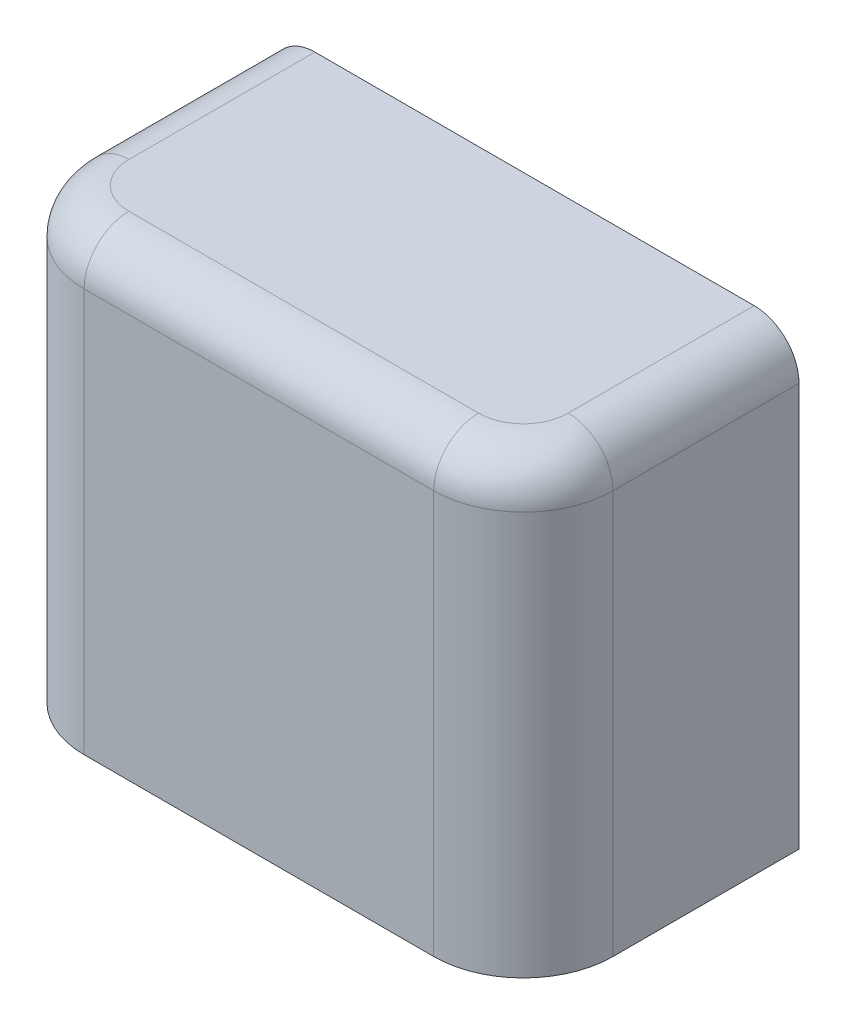
ISO-10303-21;
HEADER;
FILE_DESCRIPTION(('STEP AP214'),'2;1');
FILE_NAME('part.step','',(''),(''),'','','');
FILE_SCHEMA(('AUTOMOTIVE_DESIGN { 1 0 10303 214 1 1 1 1 }'));
ENDSEC;
DATA;
#1=APPLICATION_CONTEXT('core data for automotive mechanical design processes');
#2=APPLICATION_PROTOCOL_DEFINITION('international standard','automotive_design',2000,#1);
#3=PRODUCT_CONTEXT('',#1,'mechanical');
#4=PRODUCT('Part','Part','',(#3));
#5=PRODUCT_RELATED_PRODUCT_CATEGORY('part','',(#4));
#6=PRODUCT_DEFINITION_FORMATION('','',#4);
#7=PRODUCT_DEFINITION_CONTEXT('part definition',#1,'design');
#8=PRODUCT_DEFINITION('design','',#6,#7);
#9=PRODUCT_DEFINITION_SHAPE('','',#8);
#10=(LENGTH_UNIT() NAMED_UNIT(*) SI_UNIT(.MILLI.,.METRE.));
#11=(NAMED_UNIT(*) PLANE_ANGLE_UNIT() SI_UNIT($,.RADIAN.));
#12=(NAMED_UNIT(*) SI_UNIT($,.STERADIAN.) SOLID_ANGLE_UNIT());
#13=UNCERTAINTY_MEASURE_WITH_UNIT(LENGTH_MEASURE(1.E-05),#10,'distance_accuracy_value','');
#14=(GEOMETRIC_REPRESENTATION_CONTEXT(3) GLOBAL_UNCERTAINTY_ASSIGNED_CONTEXT((#13)) GLOBAL_UNIT_ASSIGNED_CONTEXT((#10,
#11,#12)) REPRESENTATION_CONTEXT('',''));
#15=CARTESIAN_POINT('',(0.,0.,0.));
#16=DIRECTION('',(0.,0.,1.));
#17=DIRECTION('',(1.,0.,0.));
#18=AXIS2_PLACEMENT_3D('',#15,#16,#17);
#19=CARTESIAN_POINT('',(124.500000000011,510.,21.4999999999996));
#20=DIRECTION('',(0.,-1.,0.));
#21=DIRECTION('',(0.,0.,-1.));
#22=AXIS2_PLACEMENT_3D('',#19,#20,#21);
#23=CYLINDRICAL_SURFACE('',#22,40.);
#24=DIRECTION('',(0.,-1.,0.));
#25=VECTOR('',#24,1.);
#26=CARTESIAN_POINT('',(164.500000000011,510.,21.4999999999993));
#27=LINE('',#26,#25);
#28=CARTESIAN_POINT('',(164.500000000011,490.,21.4999999999993));
#29=VERTEX_POINT('',#28);
#30=CARTESIAN_POINT('',(164.500000000011,310.,21.4999999999993));
#31=VERTEX_POINT('',#30);
#32=EDGE_CURVE('E87',#29,#31,#27,.T.);
#33=ORIENTED_EDGE('',*,*,#32,.F.);
#34=CARTESIAN_POINT('',(124.500000000011,490.,21.4999999999996));
#35=DIRECTION('',(0.,1.,0.));
#36=DIRECTION('',(0.,0.,1.));
#37=AXIS2_PLACEMENT_3D('',#34,#35,#36);
#38=CIRCLE('',#37,40.);
#39=CARTESIAN_POINT('',(124.50000000001,490.,61.5));
#40=VERTEX_POINT('',#39);
#41=EDGE_CURVE('E26',#29,#40,#38,.F.);
#42=ORIENTED_EDGE('',*,*,#41,.T.);
#43=DIRECTION('',(0.,-1.,0.));
#44=VECTOR('',#43,1.);
#45=CARTESIAN_POINT('',(124.50000000001,510.,61.5));
#46=LINE('',#45,#44);
#47=CARTESIAN_POINT('',(124.50000000001,310.,61.5));
#48=VERTEX_POINT('',#47);
#49=EDGE_CURVE('E106',#40,#48,#46,.T.);
#50=ORIENTED_EDGE('',*,*,#49,.T.);
#51=CARTESIAN_POINT('',(124.500000000011,310.,21.4999999999996));
#52=DIRECTION('',(0.,1.,0.));
#53=DIRECTION('',(0.,0.,1.));
#54=AXIS2_PLACEMENT_3D('',#51,#52,#53);
#55=CIRCLE('',#54,40.);
#56=EDGE_CURVE('E101',#48,#31,#55,.T.);
#57=ORIENTED_EDGE('',*,*,#56,.T.);
#58=EDGE_LOOP('',(#33,#42,#50,#57));
#59=FACE_BOUND('',#58,.T.);
#60=ADVANCED_FACE('F17',(#59),#23,.T.);
#61=CARTESIAN_POINT('',(164.500000000011,510.,21.4999999999993));
#62=DIRECTION('',(-1.,0.,0.));
#63=DIRECTION('',(0.,0.,1.));
#64=AXIS2_PLACEMENT_3D('',#61,#62,#63);
#65=PLANE('',#64);
#66=DIRECTION('',(0.,-1.,0.));
#67=VECTOR('',#66,1.);
#68=CARTESIAN_POINT('',(164.500000000011,510.,-61.5));
#69=LINE('',#68,#67);
#70=CARTESIAN_POINT('',(164.500000000011,490.,-61.5));
#71=VERTEX_POINT('',#70);
#72=CARTESIAN_POINT('',(164.500000000011,310.,-61.5));
#73=VERTEX_POINT('',#72);
#74=EDGE_CURVE('E95',#71,#73,#69,.T.);
#75=ORIENTED_EDGE('',*,*,#74,.F.);
#76=DIRECTION('',(0.,0.,-1.));
#77=VECTOR('',#76,1.);
#78=CARTESIAN_POINT('',(164.500000000011,490.,21.4999999999993));
#79=LINE('',#78,#77);
#80=EDGE_CURVE('E41',#71,#29,#79,.F.);
#81=ORIENTED_EDGE('',*,*,#80,.T.);
#82=ORIENTED_EDGE('',*,*,#32,.T.);
#83=DIRECTION('',(0.,0.,-1.));
#84=VECTOR('',#83,1.);
#85=CARTESIAN_POINT('',(164.500000000011,310.,21.4999999999993));
#86=LINE('',#85,#84);
#87=EDGE_CURVE('E90',#31,#73,#86,.T.);
#88=ORIENTED_EDGE('',*,*,#87,.T.);
#89=EDGE_LOOP('',(#75,#81,#82,#88));
#90=FACE_BOUND('',#89,.T.);
#91=ADVANCED_FACE('F89',(#90),#65,.F.);
#92=CARTESIAN_POINT('',(-71.4999999999913,510.,-61.4999999999976));
#93=DIRECTION('',(0.,0.,1.));
#94=DIRECTION('',(1.,0.,0.));
#95=AXIS2_PLACEMENT_3D('',#92,#93,#94);
#96=PLANE('',#95);
#97=DIRECTION('',(0.,-1.,0.));
#98=VECTOR('',#97,1.);
#99=CARTESIAN_POINT('',(-71.4999999999913,510.,-61.4999999999976));
#100=LINE('',#99,#98);
#101=CARTESIAN_POINT('',(-71.4999999999913,490.,-61.4999999999976));
#102=VERTEX_POINT('',#101);
#103=CARTESIAN_POINT('',(-71.4999999999913,310.,-61.4999999999976));
#104=VERTEX_POINT('',#103);
#105=EDGE_CURVE('E128',#102,#104,#100,.T.);
#106=ORIENTED_EDGE('',*,*,#105,.F.);
#107=CARTESIAN_POINT('',(-51.4999999999913,490.,-61.4999999999978));
#108=DIRECTION('',(0.,0.,1.));
#109=DIRECTION('',(1.,0.,0.));
#110=AXIS2_PLACEMENT_3D('',#107,#108,#109);
#111=CIRCLE('',#110,20.);
#112=CARTESIAN_POINT('',(-51.4999999999913,510.,-61.4999999999978));
#113=VERTEX_POINT('',#112);
#114=EDGE_CURVE('E145',#102,#113,#111,.F.);
#115=ORIENTED_EDGE('',*,*,#114,.T.);
#116=DIRECTION('',(-1.,0.,0.));
#117=VECTOR('',#116,1.);
#118=CARTESIAN_POINT('',(-71.4999999999913,510.,-61.4999999999976));
#119=LINE('',#118,#117);
#120=CARTESIAN_POINT('',(144.500000000011,510.,-61.5));
#121=VERTEX_POINT('',#120);
#122=EDGE_CURVE('E112',#121,#113,#119,.T.);
#123=ORIENTED_EDGE('',*,*,#122,.F.);
#124=CARTESIAN_POINT('',(144.500000000011,490.,-61.5));
#125=DIRECTION('',(0.,0.,1.));
#126=DIRECTION('',(1.,0.,0.));
#127=AXIS2_PLACEMENT_3D('',#124,#125,#126);
#128=CIRCLE('',#127,20.);
#129=EDGE_CURVE('E143',#121,#71,#128,.F.);
#130=ORIENTED_EDGE('',*,*,#129,.T.);
#131=ORIENTED_EDGE('',*,*,#74,.T.);
#132=DIRECTION('',(-1.,0.,0.));
#133=VECTOR('',#132,1.);
#134=CARTESIAN_POINT('',(-71.4999999999913,310.,-61.4999999999976));
#135=LINE('',#134,#133);
#136=EDGE_CURVE('E104',#73,#104,#135,.T.);
#137=ORIENTED_EDGE('',*,*,#136,.T.);
#138=EDGE_LOOP('',(#106,#115,#123,#130,#131,#137));
#139=FACE_BOUND('',#138,.T.);
#140=ADVANCED_FACE('F174',(#139),#96,.F.);
#141=CARTESIAN_POINT('',(-71.4999999999898,510.,21.4999999999985));
#142=DIRECTION('',(1.,0.,0.));
#143=DIRECTION('',(0.,0.,-1.));
#144=AXIS2_PLACEMENT_3D('',#141,#142,#143);
#145=PLANE('',#144);
#146=DIRECTION('',(0.,-1.,0.));
#147=VECTOR('',#146,1.);
#148=CARTESIAN_POINT('',(-71.4999999999898,510.,21.4999999999985));
#149=LINE('',#148,#147);
#150=CARTESIAN_POINT('',(-71.4999999999898,490.,21.4999999999985));
#151=VERTEX_POINT('',#150);
#152=CARTESIAN_POINT('',(-71.4999999999898,310.,21.4999999999985));
#153=VERTEX_POINT('',#152);
#154=EDGE_CURVE('E126',#151,#153,#149,.T.);
#155=ORIENTED_EDGE('',*,*,#154,.F.);
#156=DIRECTION('',(0.,0.,1.));
#157=VECTOR('',#156,1.);
#158=CARTESIAN_POINT('',(-71.4999999999913,490.,-61.4999999999976));
#159=LINE('',#158,#157);
#160=EDGE_CURVE('E141',#151,#102,#159,.F.);
#161=ORIENTED_EDGE('',*,*,#160,.T.);
#162=ORIENTED_EDGE('',*,*,#105,.T.);
#163=DIRECTION('',(0.,0.,1.));
#164=VECTOR('',#163,1.);
#165=CARTESIAN_POINT('',(-71.4999999999898,310.,21.4999999999985));
#166=LINE('',#165,#164);
#167=EDGE_CURVE('E115',#104,#153,#166,.T.);
#168=ORIENTED_EDGE('',*,*,#167,.T.);
#169=EDGE_LOOP('',(#155,#161,#162,#168));
#170=FACE_BOUND('',#169,.T.);
#171=ADVANCED_FACE('F190',(#170),#145,.F.);
#172=CARTESIAN_POINT('',(-31.4999999999898,510.,21.499999999998));
#173=DIRECTION('',(0.,-1.,0.));
#174=DIRECTION('',(0.,0.,-1.));
#175=AXIS2_PLACEMENT_3D('',#172,#173,#174);
#176=CYLINDRICAL_SURFACE('',#175,40.);
#177=DIRECTION('',(0.,-1.,0.));
#178=VECTOR('',#177,1.);
#179=CARTESIAN_POINT('',(-31.4999999999898,510.,61.499999999998));
#180=LINE('',#179,#178);
#181=CARTESIAN_POINT('',(-31.4999999999898,490.,61.499999999998));
#182=VERTEX_POINT('',#181);
#183=CARTESIAN_POINT('',(-31.4999999999898,310.,61.499999999998));
#184=VERTEX_POINT('',#183);
#185=EDGE_CURVE('E124',#182,#184,#180,.T.);
#186=ORIENTED_EDGE('',*,*,#185,.F.);
#187=CARTESIAN_POINT('',(-31.4999999999898,490.,21.499999999998));
#188=DIRECTION('',(0.,1.,0.));
#189=DIRECTION('',(0.,0.,1.));
#190=AXIS2_PLACEMENT_3D('',#187,#188,#189);
#191=CIRCLE('',#190,40.);
#192=EDGE_CURVE('E147',#182,#151,#191,.F.);
#193=ORIENTED_EDGE('',*,*,#192,.T.);
#194=ORIENTED_EDGE('',*,*,#154,.T.);
#195=CARTESIAN_POINT('',(-31.4999999999898,310.,21.499999999998));
#196=DIRECTION('',(0.,1.,0.));
#197=DIRECTION('',(0.,0.,1.));
#198=AXIS2_PLACEMENT_3D('',#195,#196,#197);
#199=CIRCLE('',#198,40.);
#200=EDGE_CURVE('E118',#153,#184,#199,.T.);
#201=ORIENTED_EDGE('',*,*,#200,.T.);
#202=EDGE_LOOP('',(#186,#193,#194,#201));
#203=FACE_BOUND('',#202,.T.);
#204=ADVANCED_FACE('F188',(#203),#176,.T.);
#205=CARTESIAN_POINT('',(-31.4999999999899,510.,61.499999999998));
#206=DIRECTION('',(0.,0.,-1.));
#207=DIRECTION('',(-1.,0.,0.));
#208=AXIS2_PLACEMENT_3D('',#205,#206,#207);
#209=PLANE('',#208);
#210=ORIENTED_EDGE('',*,*,#49,.F.);
#211=DIRECTION('',(1.,0.,0.));
#212=VECTOR('',#211,1.);
#213=CARTESIAN_POINT('',(-31.4999999999898,490.,61.499999999998));
#214=LINE('',#213,#212);
#215=EDGE_CURVE('E11',#40,#182,#214,.F.);
#216=ORIENTED_EDGE('',*,*,#215,.T.);
#217=ORIENTED_EDGE('',*,*,#185,.T.);
#218=DIRECTION('',(1.,0.,0.));
#219=VECTOR('',#218,1.);
#220=CARTESIAN_POINT('',(-31.4999999999899,310.,61.499999999998));
#221=LINE('',#220,#219);
#222=EDGE_CURVE('E121',#184,#48,#221,.T.);
#223=ORIENTED_EDGE('',*,*,#222,.T.);
#224=EDGE_LOOP('',(#210,#216,#217,#223));
#225=FACE_BOUND('',#224,.T.);
#226=ADVANCED_FACE('F193',(#225),#209,.F.);
#227=CARTESIAN_POINT('',(124.500000000011,510.,21.4999999999996));
#228=DIRECTION('',(0.,1.,0.));
#229=DIRECTION('',(0.,0.,1.));
#230=AXIS2_PLACEMENT_3D('',#227,#228,#229);
#231=PLANE('',#230);
#232=ORIENTED_EDGE('',*,*,#122,.T.);
#233=DIRECTION('',(0.,0.,1.));
#234=VECTOR('',#233,1.);
#235=CARTESIAN_POINT('',(-51.4999999999898,510.,21.4999999999981));
#236=LINE('',#235,#234);
#237=CARTESIAN_POINT('',(-51.4999999999898,510.,21.4999999999981));
#238=VERTEX_POINT('',#237);
#239=EDGE_CURVE('E138',#113,#238,#236,.T.);
#240=ORIENTED_EDGE('',*,*,#239,.T.);
#241=CARTESIAN_POINT('',(-31.4999999999898,510.,21.499999999998));
#242=DIRECTION('',(0.,1.,0.));
#243=DIRECTION('',(0.,0.,1.));
#244=AXIS2_PLACEMENT_3D('',#241,#242,#243);
#245=CIRCLE('',#244,20.);
#246=CARTESIAN_POINT('',(-31.4999999999898,510.,41.499999999998));
#247=VERTEX_POINT('',#246);
#248=EDGE_CURVE('E136',#238,#247,#245,.T.);
#249=ORIENTED_EDGE('',*,*,#248,.T.);
#250=DIRECTION('',(1.,0.,0.));
#251=VECTOR('',#250,1.);
#252=CARTESIAN_POINT('',(124.50000000001,510.,41.5));
#253=LINE('',#252,#251);
#254=CARTESIAN_POINT('',(124.500000000011,510.,41.5));
#255=VERTEX_POINT('',#254);
#256=EDGE_CURVE('E94',#247,#255,#253,.T.);
#257=ORIENTED_EDGE('',*,*,#256,.T.);
#258=CARTESIAN_POINT('',(124.500000000011,510.,21.4999999999996));
#259=DIRECTION('',(0.,1.,0.));
#260=DIRECTION('',(0.,0.,1.));
#261=AXIS2_PLACEMENT_3D('',#258,#259,#260);
#262=CIRCLE('',#261,20.);
#263=CARTESIAN_POINT('',(144.500000000011,510.,21.4999999999993));
#264=VERTEX_POINT('',#263);
#265=EDGE_CURVE('E132',#255,#264,#262,.T.);
#266=ORIENTED_EDGE('',*,*,#265,.T.);
#267=DIRECTION('',(0.,0.,-1.));
#268=VECTOR('',#267,1.);
#269=CARTESIAN_POINT('',(144.500000000011,510.,-61.5));
#270=LINE('',#269,#268);
#271=EDGE_CURVE('E134',#264,#121,#270,.T.);
#272=ORIENTED_EDGE('',*,*,#271,.T.);
#273=EDGE_LOOP('',(#232,#240,#249,#257,#266,#272));
#274=FACE_BOUND('',#273,.T.);
#275=ADVANCED_FACE('F168',(#274),#231,.T.);
#276=CARTESIAN_POINT('',(124.500000000011,310.,21.4999999999996));
#277=DIRECTION('',(0.,1.,0.));
#278=DIRECTION('',(0.,0.,1.));
#279=AXIS2_PLACEMENT_3D('',#276,#277,#278);
#280=PLANE('',#279);
#281=ORIENTED_EDGE('',*,*,#56,.F.);
#282=ORIENTED_EDGE('',*,*,#222,.F.);
#283=ORIENTED_EDGE('',*,*,#200,.F.);
#284=ORIENTED_EDGE('',*,*,#167,.F.);
#285=ORIENTED_EDGE('',*,*,#136,.F.);
#286=ORIENTED_EDGE('',*,*,#87,.F.);
#287=EDGE_LOOP('',(#281,#282,#283,#284,#285,#286));
#288=FACE_BOUND('',#287,.T.);
#289=ADVANCED_FACE('F99',(#288),#280,.F.);
#290=CARTESIAN_POINT('',(144.500000000011,490.,21.4999999999996));
#291=DIRECTION('',(0.,0.,1.));
#292=DIRECTION('',(1.,0.,0.));
#293=AXIS2_PLACEMENT_3D('',#290,#291,#292);
#294=CYLINDRICAL_SURFACE('',#293,20.);
#295=ORIENTED_EDGE('',*,*,#129,.F.);
#296=ORIENTED_EDGE('',*,*,#271,.F.);
#297=CARTESIAN_POINT('',(144.500000000011,490.,21.4999999999993));
#298=DIRECTION('',(0.,0.,1.));
#299=DIRECTION('',(1.,0.,0.));
#300=AXIS2_PLACEMENT_3D('',#297,#298,#299);
#301=CIRCLE('',#300,20.);
#302=EDGE_CURVE('E21',#29,#264,#301,.T.);
#303=ORIENTED_EDGE('',*,*,#302,.F.);
#304=ORIENTED_EDGE('',*,*,#80,.F.);
#305=EDGE_LOOP('',(#295,#296,#303,#304));
#306=FACE_BOUND('',#305,.T.);
#307=ADVANCED_FACE('F19',(#306),#294,.T.);
#308=CARTESIAN_POINT('',(124.500000000011,490.,21.4999999999996));
#309=DIRECTION('',(0.,1.,0.));
#310=DIRECTION('',(0.,0.,1.));
#311=AXIS2_PLACEMENT_3D('',#308,#309,#310);
#312=DEGENERATE_TOROIDAL_SURFACE('',#311,20.,20.,.T.);
#313=ORIENTED_EDGE('',*,*,#302,.T.);
#314=ORIENTED_EDGE('',*,*,#265,.F.);
#315=CARTESIAN_POINT('',(124.500000000011,490.,41.5));
#316=DIRECTION('',(-1.,0.,0.));
#317=DIRECTION('',(0.,0.,1.));
#318=AXIS2_PLACEMENT_3D('',#315,#316,#317);
#319=CIRCLE('',#318,20.);
#320=EDGE_CURVE('E110',#40,#255,#319,.T.);
#321=ORIENTED_EDGE('',*,*,#320,.F.);
#322=ORIENTED_EDGE('',*,*,#41,.F.);
#323=EDGE_LOOP('',(#313,#314,#321,#322));
#324=FACE_BOUND('',#323,.T.);
#325=ADVANCED_FACE('F164',(#324),#312,.T.);
#326=CARTESIAN_POINT('',(124.500000000011,490.,41.5));
#327=DIRECTION('',(-1.,0.,0.));
#328=DIRECTION('',(0.,0.,1.));
#329=AXIS2_PLACEMENT_3D('',#326,#327,#328);
#330=CYLINDRICAL_SURFACE('',#329,20.);
#331=ORIENTED_EDGE('',*,*,#320,.T.);
#332=ORIENTED_EDGE('',*,*,#256,.F.);
#333=CARTESIAN_POINT('',(-31.4999999999896,490.,41.499999999998));
#334=DIRECTION('',(-1.,0.,0.));
#335=DIRECTION('',(0.,0.,1.));
#336=AXIS2_PLACEMENT_3D('',#333,#334,#335);
#337=CIRCLE('',#336,20.);
#338=EDGE_CURVE('E153',#182,#247,#337,.T.);
#339=ORIENTED_EDGE('',*,*,#338,.F.);
#340=ORIENTED_EDGE('',*,*,#215,.F.);
#341=EDGE_LOOP('',(#331,#332,#339,#340));
#342=FACE_BOUND('',#341,.T.);
#343=ADVANCED_FACE('F160',(#342),#330,.T.);
#344=CARTESIAN_POINT('',(-31.4999999999898,490.,21.499999999998));
#345=DIRECTION('',(0.,1.,0.));
#346=DIRECTION('',(0.,0.,1.));
#347=AXIS2_PLACEMENT_3D('',#344,#345,#346);
#348=DEGENERATE_TOROIDAL_SURFACE('',#347,20.,20.,.T.);
#349=ORIENTED_EDGE('',*,*,#338,.T.);
#350=ORIENTED_EDGE('',*,*,#248,.F.);
#351=CARTESIAN_POINT('',(-51.4999999999898,490.,21.4999999999982));
#352=DIRECTION('',(0.,0.,-1.));
#353=DIRECTION('',(-1.,0.,0.));
#354=AXIS2_PLACEMENT_3D('',#351,#352,#353);
#355=CIRCLE('',#354,20.);
#356=EDGE_CURVE('E151',#151,#238,#355,.T.);
#357=ORIENTED_EDGE('',*,*,#356,.F.);
#358=ORIENTED_EDGE('',*,*,#192,.F.);
#359=EDGE_LOOP('',(#349,#350,#357,#358));
#360=FACE_BOUND('',#359,.T.);
#361=ADVANCED_FACE('F184',(#360),#348,.T.);
#362=CARTESIAN_POINT('',(-51.4999999999898,490.,21.5000000000029));
#363=DIRECTION('',(0.,0.,-1.));
#364=DIRECTION('',(-1.,0.,0.));
#365=AXIS2_PLACEMENT_3D('',#362,#363,#364);
#366=CYLINDRICAL_SURFACE('',#365,20.);
#367=ORIENTED_EDGE('',*,*,#114,.F.);
#368=ORIENTED_EDGE('',*,*,#160,.F.);
#369=ORIENTED_EDGE('',*,*,#356,.T.);
#370=ORIENTED_EDGE('',*,*,#239,.F.);
#371=EDGE_LOOP('',(#367,#368,#369,#370));
#372=FACE_BOUND('',#371,.T.);
#373=ADVANCED_FACE('F178',(#372),#366,.T.);
#374=CLOSED_SHELL('',(#60,#91,#140,#171,#204,#226,#275,#289,#307,#325,#343,#361,#373));
#375=MANIFOLD_SOLID_BREP('B1',#374);
#376=ADVANCED_BREP_SHAPE_REPRESENTATION('',(#18,#375),#14);
#377=SHAPE_DEFINITION_REPRESENTATION(#9,#376);
ENDSEC;
END-ISO-10303-21;
